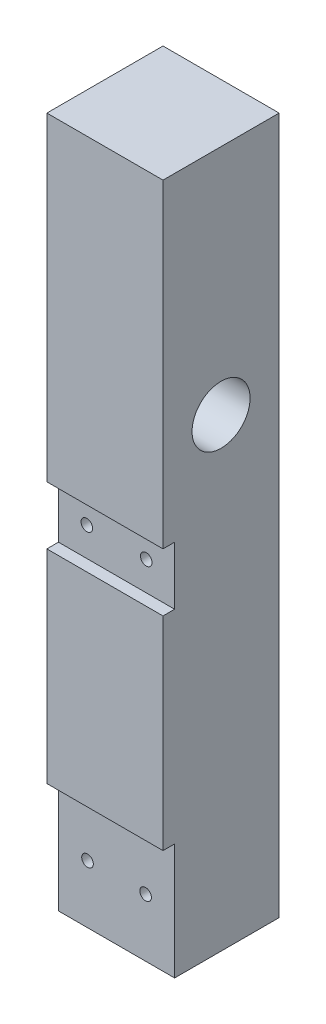
ISO-10303-21;
HEADER;
FILE_DESCRIPTION(('STEP AP214'),'2;1');
FILE_NAME('part.step','',(''),(''),'','','');
FILE_SCHEMA(('AUTOMOTIVE_DESIGN { 1 0 10303 214 1 1 1 1 }'));
ENDSEC;
DATA;
#1=APPLICATION_CONTEXT('core data for automotive mechanical design processes');
#2=APPLICATION_PROTOCOL_DEFINITION('international standard','automotive_design',2000,#1);
#3=PRODUCT_CONTEXT('',#1,'mechanical');
#4=PRODUCT('Part','Part','',(#3));
#5=PRODUCT_RELATED_PRODUCT_CATEGORY('part','',(#4));
#6=PRODUCT_DEFINITION_FORMATION('','',#4);
#7=PRODUCT_DEFINITION_CONTEXT('part definition',#1,'design');
#8=PRODUCT_DEFINITION('design','',#6,#7);
#9=PRODUCT_DEFINITION_SHAPE('','',#8);
#10=(LENGTH_UNIT() NAMED_UNIT(*) SI_UNIT(.MILLI.,.METRE.));
#11=(NAMED_UNIT(*) PLANE_ANGLE_UNIT() SI_UNIT($,.RADIAN.));
#12=(NAMED_UNIT(*) SI_UNIT($,.STERADIAN.) SOLID_ANGLE_UNIT());
#13=UNCERTAINTY_MEASURE_WITH_UNIT(LENGTH_MEASURE(1.E-05),#10,'distance_accuracy_value','');
#14=(GEOMETRIC_REPRESENTATION_CONTEXT(3) GLOBAL_UNCERTAINTY_ASSIGNED_CONTEXT((#13)) GLOBAL_UNIT_ASSIGNED_CONTEXT((#10,
#11,#12)) REPRESENTATION_CONTEXT('',''));
#15=CARTESIAN_POINT('',(0.,0.,0.));
#16=DIRECTION('',(0.,0.,1.));
#17=DIRECTION('',(1.,0.,0.));
#18=AXIS2_PLACEMENT_3D('',#15,#16,#17);
#19=CARTESIAN_POINT('',(-15.119461257796,60.,0.));
#20=DIRECTION('',(0.,0.,-1.));
#21=DIRECTION('',(0.,1.,0.));
#22=AXIS2_PLACEMENT_3D('',#19,#20,#21);
#23=CYLINDRICAL_SURFACE('',#22,1.);
#24=CARTESIAN_POINT('',(-15.119461257796,60.,-15.));
#25=DIRECTION('',(0.,0.,-1.));
#26=DIRECTION('',(0.,1.,0.));
#27=AXIS2_PLACEMENT_3D('',#24,#25,#26);
#28=CIRCLE('',#27,1.);
#29=CARTESIAN_POINT('',(-15.119461257796,61.,-15.));
#30=VERTEX_POINT('',#29);
#31=EDGE_CURVE('E42',#30,#30,#28,.T.);
#32=ORIENTED_EDGE('',*,*,#31,.T.);
#33=EDGE_LOOP('',(#32));
#34=FACE_BOUND('',#33,.T.);
#35=CARTESIAN_POINT('',(-15.119461257796,60.,-2.));
#36=DIRECTION('',(0.,0.,1.));
#37=DIRECTION('',(1.,0.,0.));
#38=AXIS2_PLACEMENT_3D('',#35,#36,#37);
#39=CIRCLE('',#38,1.);
#40=CARTESIAN_POINT('',(-14.119461257796,60.,-2.));
#41=VERTEX_POINT('',#40);
#42=EDGE_CURVE('E173',#41,#41,#39,.T.);
#43=ORIENTED_EDGE('',*,*,#42,.T.);
#44=EDGE_LOOP('',(#43));
#45=FACE_BOUND('',#44,.T.);
#46=ADVANCED_FACE('F38',(#34,#45),#23,.F.);
#47=CARTESIAN_POINT('',(-4.88053874220398,60.,0.));
#48=DIRECTION('',(0.,0.,-1.));
#49=DIRECTION('',(0.,1.,0.));
#50=AXIS2_PLACEMENT_3D('',#47,#48,#49);
#51=CYLINDRICAL_SURFACE('',#50,1.);
#52=CARTESIAN_POINT('',(-4.88053874220398,60.,-15.));
#53=DIRECTION('',(0.,0.,-1.));
#54=DIRECTION('',(0.,1.,0.));
#55=AXIS2_PLACEMENT_3D('',#52,#53,#54);
#56=CIRCLE('',#55,1.);
#57=CARTESIAN_POINT('',(-4.88053874220398,61.,-15.));
#58=VERTEX_POINT('',#57);
#59=EDGE_CURVE('E180',#58,#58,#56,.F.);
#60=ORIENTED_EDGE('',*,*,#59,.F.);
#61=EDGE_LOOP('',(#60));
#62=FACE_BOUND('',#61,.T.);
#63=CARTESIAN_POINT('',(-4.88053874220398,60.,-2.));
#64=DIRECTION('',(0.,0.,1.));
#65=DIRECTION('',(1.,0.,0.));
#66=AXIS2_PLACEMENT_3D('',#63,#64,#65);
#67=CIRCLE('',#66,1.);
#68=CARTESIAN_POINT('',(-3.88053874220398,60.,-2.));
#69=VERTEX_POINT('',#68);
#70=EDGE_CURVE('E170',#69,#69,#67,.F.);
#71=ORIENTED_EDGE('',*,*,#70,.F.);
#72=EDGE_LOOP('',(#71));
#73=FACE_BOUND('',#72,.T.);
#74=ADVANCED_FACE('F321',(#62,#73),#51,.F.);
#75=CARTESIAN_POINT('',(-20.,120.,0.));
#76=DIRECTION('',(0.,0.,1.));
#77=DIRECTION('',(0.,-1.,0.));
#78=AXIS2_PLACEMENT_3D('',#75,#76,#77);
#79=PLANE('',#78);
#80=DIRECTION('',(1.,0.,0.));
#81=VECTOR('',#80,1.);
#82=CARTESIAN_POINT('',(-20.,55.,0.));
#83=LINE('',#82,#81);
#84=CARTESIAN_POINT('',(-20.,55.,0.));
#85=VERTEX_POINT('',#84);
#86=CARTESIAN_POINT('',(0.,55.,0.));
#87=VERTEX_POINT('',#86);
#88=EDGE_CURVE('E133',#85,#87,#83,.T.);
#89=ORIENTED_EDGE('',*,*,#88,.F.);
#90=DIRECTION('',(0.,-1.,0.));
#91=VECTOR('',#90,1.);
#92=CARTESIAN_POINT('',(-20.,120.,0.));
#93=LINE('',#92,#91);
#94=CARTESIAN_POINT('',(-20.,20.,0.));
#95=VERTEX_POINT('',#94);
#96=EDGE_CURVE('E218',#85,#95,#93,.T.);
#97=ORIENTED_EDGE('',*,*,#96,.T.);
#98=DIRECTION('',(-1.,0.,0.));
#99=VECTOR('',#98,1.);
#100=CARTESIAN_POINT('',(-20.,20.,0.));
#101=LINE('',#100,#99);
#102=CARTESIAN_POINT('',(0.,20.,0.));
#103=VERTEX_POINT('',#102);
#104=EDGE_CURVE('E150',#103,#95,#101,.T.);
#105=ORIENTED_EDGE('',*,*,#104,.F.);
#106=DIRECTION('',(0.,-1.,0.));
#107=VECTOR('',#106,1.);
#108=CARTESIAN_POINT('',(0.,120.,0.));
#109=LINE('',#108,#107);
#110=EDGE_CURVE('E213',#87,#103,#109,.T.);
#111=ORIENTED_EDGE('',*,*,#110,.F.);
#112=EDGE_LOOP('',(#89,#97,#105,#111));
#113=FACE_BOUND('',#112,.T.);
#114=ADVANCED_FACE('F298',(#113),#79,.T.);
#115=CARTESIAN_POINT('',(-5.,9.99999999999999,-20.));
#116=DIRECTION('',(0.,0.,1.));
#117=DIRECTION('',(1.,0.,0.));
#118=AXIS2_PLACEMENT_3D('',#115,#116,#117);
#119=CYLINDRICAL_SURFACE('',#118,1.);
#120=CARTESIAN_POINT('',(-5.,9.99999999999999,-15.));
#121=DIRECTION('',(0.,0.,-1.));
#122=DIRECTION('',(0.,1.,0.));
#123=AXIS2_PLACEMENT_3D('',#120,#121,#122);
#124=CIRCLE('',#123,1.);
#125=CARTESIAN_POINT('',(-5.,11.,-15.));
#126=VERTEX_POINT('',#125);
#127=EDGE_CURVE('E209',#126,#126,#124,.T.);
#128=ORIENTED_EDGE('',*,*,#127,.T.);
#129=EDGE_LOOP('',(#128));
#130=FACE_BOUND('',#129,.T.);
#131=CARTESIAN_POINT('',(-5.,9.99999999999999,-2.));
#132=DIRECTION('',(0.,0.,1.));
#133=DIRECTION('',(1.,0.,0.));
#134=AXIS2_PLACEMENT_3D('',#131,#132,#133);
#135=CIRCLE('',#134,1.);
#136=CARTESIAN_POINT('',(-4.,9.99999999999999,-2.));
#137=VERTEX_POINT('',#136);
#138=EDGE_CURVE('E166',#137,#137,#135,.T.);
#139=ORIENTED_EDGE('',*,*,#138,.T.);
#140=EDGE_LOOP('',(#139));
#141=FACE_BOUND('',#140,.T.);
#142=ADVANCED_FACE('F317',(#130,#141),#119,.F.);
#143=CARTESIAN_POINT('',(-15.,9.99999999999999,-20.));
#144=DIRECTION('',(0.,0.,1.));
#145=DIRECTION('',(1.,0.,0.));
#146=AXIS2_PLACEMENT_3D('',#143,#144,#145);
#147=CYLINDRICAL_SURFACE('',#146,1.);
#148=CARTESIAN_POINT('',(-15.,9.99999999999999,-15.));
#149=DIRECTION('',(0.,0.,-1.));
#150=DIRECTION('',(0.,1.,0.));
#151=AXIS2_PLACEMENT_3D('',#148,#149,#150);
#152=CIRCLE('',#151,1.);
#153=CARTESIAN_POINT('',(-15.,11.,-15.));
#154=VERTEX_POINT('',#153);
#155=EDGE_CURVE('E192',#154,#154,#152,.F.);
#156=ORIENTED_EDGE('',*,*,#155,.F.);
#157=EDGE_LOOP('',(#156));
#158=FACE_BOUND('',#157,.T.);
#159=CARTESIAN_POINT('',(-15.,9.99999999999999,-2.));
#160=DIRECTION('',(0.,0.,1.));
#161=DIRECTION('',(1.,0.,0.));
#162=AXIS2_PLACEMENT_3D('',#159,#160,#161);
#163=CIRCLE('',#162,1.);
#164=CARTESIAN_POINT('',(-14.,9.99999999999999,-2.));
#165=VERTEX_POINT('',#164);
#166=EDGE_CURVE('E163',#165,#165,#163,.F.);
#167=ORIENTED_EDGE('',*,*,#166,.F.);
#168=EDGE_LOOP('',(#167));
#169=FACE_BOUND('',#168,.T.);
#170=ADVANCED_FACE('F312',(#158,#169),#147,.F.);
#171=CARTESIAN_POINT('',(-20.,0.,0.));
#172=DIRECTION('',(0.,-1.,0.));
#173=DIRECTION('',(0.,0.,-1.));
#174=AXIS2_PLACEMENT_3D('',#171,#172,#173);
#175=PLANE('',#174);
#176=DIRECTION('',(0.,0.,-1.));
#177=VECTOR('',#176,1.);
#178=CARTESIAN_POINT('',(0.,0.,0.));
#179=LINE('',#178,#177);
#180=CARTESIAN_POINT('',(0.,0.,-2.));
#181=VERTEX_POINT('',#180);
#182=CARTESIAN_POINT('',(0.,0.,-20.));
#183=VERTEX_POINT('',#182);
#184=EDGE_CURVE('E228',#181,#183,#179,.T.);
#185=ORIENTED_EDGE('',*,*,#184,.F.);
#186=DIRECTION('',(1.,0.,0.));
#187=VECTOR('',#186,1.);
#188=CARTESIAN_POINT('',(-20.,0.,-2.));
#189=LINE('',#188,#187);
#190=CARTESIAN_POINT('',(-20.,0.,-2.));
#191=VERTEX_POINT('',#190);
#192=EDGE_CURVE('E63',#191,#181,#189,.T.);
#193=ORIENTED_EDGE('',*,*,#192,.F.);
#194=DIRECTION('',(0.,0.,-1.));
#195=VECTOR('',#194,1.);
#196=CARTESIAN_POINT('',(-20.,0.,0.));
#197=LINE('',#196,#195);
#198=CARTESIAN_POINT('',(-20.,0.,-20.));
#199=VERTEX_POINT('',#198);
#200=EDGE_CURVE('E217',#191,#199,#197,.T.);
#201=ORIENTED_EDGE('',*,*,#200,.T.);
#202=DIRECTION('',(1.,0.,0.));
#203=VECTOR('',#202,1.);
#204=CARTESIAN_POINT('',(-20.,0.,-20.));
#205=LINE('',#204,#203);
#206=EDGE_CURVE('E226',#199,#183,#205,.T.);
#207=ORIENTED_EDGE('',*,*,#206,.T.);
#208=EDGE_LOOP('',(#185,#193,#201,#207));
#209=FACE_BOUND('',#208,.T.);
#210=ADVANCED_FACE('F310',(#209),#175,.T.);
#211=DIRECTION('',(-1.,0.,0.));
#212=VECTOR('',#211,1.);
#213=CARTESIAN_POINT('',(-20.,65.,0.));
#214=LINE('',#213,#212);
#215=CARTESIAN_POINT('',(0.,65.,0.));
#216=VERTEX_POINT('',#215);
#217=CARTESIAN_POINT('',(-20.,65.,0.));
#218=VERTEX_POINT('',#217);
#219=EDGE_CURVE('E161',#216,#218,#214,.T.);
#220=ORIENTED_EDGE('',*,*,#219,.F.);
#221=CARTESIAN_POINT('',(0.,120.,0.));
#222=VERTEX_POINT('',#221);
#223=EDGE_CURVE('E140',#222,#216,#109,.T.);
#224=ORIENTED_EDGE('',*,*,#223,.F.);
#225=DIRECTION('',(1.,0.,0.));
#226=VECTOR('',#225,1.);
#227=CARTESIAN_POINT('',(-20.,120.,0.));
#228=LINE('',#227,#226);
#229=CARTESIAN_POINT('',(-20.,120.,0.));
#230=VERTEX_POINT('',#229);
#231=EDGE_CURVE('E12',#230,#222,#228,.T.);
#232=ORIENTED_EDGE('',*,*,#231,.F.);
#233=EDGE_CURVE('E214',#230,#218,#93,.T.);
#234=ORIENTED_EDGE('',*,*,#233,.T.);
#235=EDGE_LOOP('',(#220,#224,#232,#234));
#236=FACE_BOUND('',#235,.T.);
#237=ADVANCED_FACE('F40',(#236),#79,.T.);
#238=CARTESIAN_POINT('',(-20.,120.,-20.));
#239=DIRECTION('',(0.,0.,-1.));
#240=DIRECTION('',(0.,1.,0.));
#241=AXIS2_PLACEMENT_3D('',#238,#239,#240);
#242=PLANE('',#241);
#243=CARTESIAN_POINT('',(-4.88053874220398,60.,-20.));
#244=DIRECTION('',(0.,0.,-1.));
#245=DIRECTION('',(0.,1.,0.));
#246=AXIS2_PLACEMENT_3D('',#243,#244,#245);
#247=CIRCLE('',#246,2.);
#248=CARTESIAN_POINT('',(-4.88053874220398,62.,-20.));
#249=VERTEX_POINT('',#248);
#250=EDGE_CURVE('E181',#249,#249,#247,.T.);
#251=ORIENTED_EDGE('',*,*,#250,.F.);
#252=EDGE_LOOP('',(#251));
#253=FACE_BOUND('',#252,.T.);
#254=CARTESIAN_POINT('',(-15.119461257796,60.,-20.));
#255=DIRECTION('',(0.,0.,-1.));
#256=DIRECTION('',(0.,1.,0.));
#257=AXIS2_PLACEMENT_3D('',#254,#255,#256);
#258=CIRCLE('',#257,2.);
#259=CARTESIAN_POINT('',(-15.119461257796,62.,-20.));
#260=VERTEX_POINT('',#259);
#261=EDGE_CURVE('E176',#260,#260,#258,.T.);
#262=ORIENTED_EDGE('',*,*,#261,.F.);
#263=EDGE_LOOP('',(#262));
#264=FACE_BOUND('',#263,.T.);
#265=CARTESIAN_POINT('',(-5.,9.99999999999999,-20.));
#266=DIRECTION('',(0.,0.,-1.));
#267=DIRECTION('',(0.,1.,0.));
#268=AXIS2_PLACEMENT_3D('',#265,#266,#267);
#269=CIRCLE('',#268,2.);
#270=CARTESIAN_POINT('',(-5.,12.,-20.));
#271=VERTEX_POINT('',#270);
#272=EDGE_CURVE('E193',#271,#271,#269,.T.);
#273=ORIENTED_EDGE('',*,*,#272,.F.);
#274=EDGE_LOOP('',(#273));
#275=FACE_BOUND('',#274,.T.);
#276=CARTESIAN_POINT('',(-15.,9.99999999999999,-20.));
#277=DIRECTION('',(0.,0.,-1.));
#278=DIRECTION('',(0.,1.,0.));
#279=AXIS2_PLACEMENT_3D('',#276,#277,#278);
#280=CIRCLE('',#279,2.);
#281=CARTESIAN_POINT('',(-15.,12.,-20.));
#282=VERTEX_POINT('',#281);
#283=EDGE_CURVE('E199',#282,#282,#280,.T.);
#284=ORIENTED_EDGE('',*,*,#283,.F.);
#285=EDGE_LOOP('',(#284));
#286=FACE_BOUND('',#285,.T.);
#287=DIRECTION('',(0.,1.,0.));
#288=VECTOR('',#287,1.);
#289=CARTESIAN_POINT('',(0.,120.,-20.));
#290=LINE('',#289,#288);
#291=CARTESIAN_POINT('',(0.,120.,-20.));
#292=VERTEX_POINT('',#291);
#293=EDGE_CURVE('E230',#183,#292,#290,.T.);
#294=ORIENTED_EDGE('',*,*,#293,.F.);
#295=ORIENTED_EDGE('',*,*,#206,.F.);
#296=DIRECTION('',(0.,1.,0.));
#297=VECTOR('',#296,1.);
#298=CARTESIAN_POINT('',(-20.,120.,-20.));
#299=LINE('',#298,#297);
#300=CARTESIAN_POINT('',(-20.,120.,-20.));
#301=VERTEX_POINT('',#300);
#302=EDGE_CURVE('E220',#199,#301,#299,.T.);
#303=ORIENTED_EDGE('',*,*,#302,.T.);
#304=DIRECTION('',(1.,0.,0.));
#305=VECTOR('',#304,1.);
#306=CARTESIAN_POINT('',(-20.,120.,-20.));
#307=LINE('',#306,#305);
#308=EDGE_CURVE('E47',#301,#292,#307,.T.);
#309=ORIENTED_EDGE('',*,*,#308,.T.);
#310=EDGE_LOOP('',(#294,#295,#303,#309));
#311=FACE_BOUND('',#310,.T.);
#312=ADVANCED_FACE('F265',(#253,#264,#275,#286,#311),#242,.T.);
#313=CARTESIAN_POINT('',(-20.,80.,-10.));
#314=DIRECTION('',(1.,0.,0.));
#315=DIRECTION('',(0.,0.,-1.));
#316=AXIS2_PLACEMENT_3D('',#313,#314,#315);
#317=CYLINDRICAL_SURFACE('',#316,2.5);
#318=CARTESIAN_POINT('',(-20.,80.,-10.));
#319=DIRECTION('',(1.,0.,0.));
#320=DIRECTION('',(0.,0.,-1.));
#321=AXIS2_PLACEMENT_3D('',#318,#319,#320);
#322=CIRCLE('',#321,2.5);
#323=CARTESIAN_POINT('',(-20.,80.,-12.5));
#324=VERTEX_POINT('',#323);
#325=EDGE_CURVE('E210',#324,#324,#322,.T.);
#326=ORIENTED_EDGE('',*,*,#325,.F.);
#327=EDGE_LOOP('',(#326));
#328=FACE_BOUND('',#327,.T.);
#329=CARTESIAN_POINT('',(-10.,80.,-10.));
#330=DIRECTION('',(1.,0.,0.));
#331=DIRECTION('',(0.,0.,-1.));
#332=AXIS2_PLACEMENT_3D('',#329,#330,#331);
#333=CIRCLE('',#332,2.5);
#334=CARTESIAN_POINT('',(-10.,80.,-12.5));
#335=VERTEX_POINT('',#334);
#336=EDGE_CURVE('E205',#335,#335,#333,.F.);
#337=ORIENTED_EDGE('',*,*,#336,.F.);
#338=EDGE_LOOP('',(#337));
#339=FACE_BOUND('',#338,.T.);
#340=ADVANCED_FACE('F268',(#328,#339),#317,.F.);
#341=CARTESIAN_POINT('',(-20.,120.,0.));
#342=DIRECTION('',(0.,1.,0.));
#343=DIRECTION('',(0.,0.,1.));
#344=AXIS2_PLACEMENT_3D('',#341,#342,#343);
#345=PLANE('',#344);
#346=DIRECTION('',(0.,0.,1.));
#347=VECTOR('',#346,1.);
#348=CARTESIAN_POINT('',(0.,120.,0.));
#349=LINE('',#348,#347);
#350=EDGE_CURVE('E233',#292,#222,#349,.T.);
#351=ORIENTED_EDGE('',*,*,#350,.F.);
#352=ORIENTED_EDGE('',*,*,#308,.F.);
#353=DIRECTION('',(0.,0.,1.));
#354=VECTOR('',#353,1.);
#355=CARTESIAN_POINT('',(-20.,120.,0.));
#356=LINE('',#355,#354);
#357=EDGE_CURVE('E223',#301,#230,#356,.T.);
#358=ORIENTED_EDGE('',*,*,#357,.T.);
#359=ORIENTED_EDGE('',*,*,#231,.T.);
#360=EDGE_LOOP('',(#351,#352,#358,#359));
#361=FACE_BOUND('',#360,.T.);
#362=ADVANCED_FACE('F281',(#361),#345,.T.);
#363=CARTESIAN_POINT('',(-20.,0.,0.));
#364=DIRECTION('',(1.,0.,0.));
#365=DIRECTION('',(0.,0.,-1.));
#366=AXIS2_PLACEMENT_3D('',#363,#364,#365);
#367=PLANE('',#366);
#368=ORIENTED_EDGE('',*,*,#96,.F.);
#369=DIRECTION('',(0.,0.,1.));
#370=VECTOR('',#369,1.);
#371=CARTESIAN_POINT('',(-20.,55.,-2.));
#372=LINE('',#371,#370);
#373=CARTESIAN_POINT('',(-20.,55.,-2.));
#374=VERTEX_POINT('',#373);
#375=EDGE_CURVE('E142',#374,#85,#372,.T.);
#376=ORIENTED_EDGE('',*,*,#375,.F.);
#377=DIRECTION('',(0.,-1.,0.));
#378=VECTOR('',#377,1.);
#379=CARTESIAN_POINT('',(-20.,65.,-2.));
#380=LINE('',#379,#378);
#381=CARTESIAN_POINT('',(-20.,65.,-2.));
#382=VERTEX_POINT('',#381);
#383=EDGE_CURVE('E125',#382,#374,#380,.T.);
#384=ORIENTED_EDGE('',*,*,#383,.F.);
#385=DIRECTION('',(0.,0.,1.));
#386=VECTOR('',#385,1.);
#387=CARTESIAN_POINT('',(-20.,65.,-2.));
#388=LINE('',#387,#386);
#389=EDGE_CURVE('E123',#382,#218,#388,.T.);
#390=ORIENTED_EDGE('',*,*,#389,.T.);
#391=ORIENTED_EDGE('',*,*,#233,.F.);
#392=ORIENTED_EDGE('',*,*,#357,.F.);
#393=ORIENTED_EDGE('',*,*,#302,.F.);
#394=ORIENTED_EDGE('',*,*,#200,.F.);
#395=DIRECTION('',(0.,-1.,0.));
#396=VECTOR('',#395,1.);
#397=CARTESIAN_POINT('',(-20.,20.,-2.));
#398=LINE('',#397,#396);
#399=CARTESIAN_POINT('',(-20.,20.,-2.));
#400=VERTEX_POINT('',#399);
#401=EDGE_CURVE('E153',#400,#191,#398,.T.);
#402=ORIENTED_EDGE('',*,*,#401,.F.);
#403=DIRECTION('',(0.,0.,1.));
#404=VECTOR('',#403,1.);
#405=CARTESIAN_POINT('',(-20.,20.,-2.));
#406=LINE('',#405,#404);
#407=EDGE_CURVE('E158',#400,#95,#406,.T.);
#408=ORIENTED_EDGE('',*,*,#407,.T.);
#409=EDGE_LOOP('',(#368,#376,#384,#390,#391,#392,#393,#394,#402,#408));
#410=FACE_BOUND('',#409,.T.);
#411=ORIENTED_EDGE('',*,*,#325,.T.);
#412=EDGE_LOOP('',(#411));
#413=FACE_BOUND('',#412,.T.);
#414=ADVANCED_FACE('F301',(#410,#413),#367,.F.);
#415=CARTESIAN_POINT('',(0.,0.,0.));
#416=DIRECTION('',(1.,0.,0.));
#417=DIRECTION('',(0.,0.,-1.));
#418=AXIS2_PLACEMENT_3D('',#415,#416,#417);
#419=PLANE('',#418);
#420=DIRECTION('',(0.,0.,1.));
#421=VECTOR('',#420,1.);
#422=CARTESIAN_POINT('',(0.,55.,-2.));
#423=LINE('',#422,#421);
#424=CARTESIAN_POINT('',(0.,55.,-2.));
#425=VERTEX_POINT('',#424);
#426=EDGE_CURVE('E167',#425,#87,#423,.T.);
#427=ORIENTED_EDGE('',*,*,#426,.T.);
#428=ORIENTED_EDGE('',*,*,#110,.T.);
#429=DIRECTION('',(0.,0.,1.));
#430=VECTOR('',#429,1.);
#431=CARTESIAN_POINT('',(0.,20.,-2.));
#432=LINE('',#431,#430);
#433=CARTESIAN_POINT('',(0.,20.,-2.));
#434=VERTEX_POINT('',#433);
#435=EDGE_CURVE('E156',#434,#103,#432,.T.);
#436=ORIENTED_EDGE('',*,*,#435,.F.);
#437=DIRECTION('',(0.,1.,0.));
#438=VECTOR('',#437,1.);
#439=CARTESIAN_POINT('',(0.,20.,-2.));
#440=LINE('',#439,#438);
#441=EDGE_CURVE('E147',#181,#434,#440,.T.);
#442=ORIENTED_EDGE('',*,*,#441,.F.);
#443=ORIENTED_EDGE('',*,*,#184,.T.);
#444=ORIENTED_EDGE('',*,*,#293,.T.);
#445=ORIENTED_EDGE('',*,*,#350,.T.);
#446=ORIENTED_EDGE('',*,*,#223,.T.);
#447=DIRECTION('',(0.,0.,1.));
#448=VECTOR('',#447,1.);
#449=CARTESIAN_POINT('',(0.,65.,-2.));
#450=LINE('',#449,#448);
#451=CARTESIAN_POINT('',(0.,65.,-2.));
#452=VERTEX_POINT('',#451);
#453=EDGE_CURVE('E120',#452,#216,#450,.T.);
#454=ORIENTED_EDGE('',*,*,#453,.F.);
#455=DIRECTION('',(0.,1.,0.));
#456=VECTOR('',#455,1.);
#457=CARTESIAN_POINT('',(0.,65.,-2.));
#458=LINE('',#457,#456);
#459=EDGE_CURVE('E126',#425,#452,#458,.T.);
#460=ORIENTED_EDGE('',*,*,#459,.F.);
#461=EDGE_LOOP('',(#427,#428,#436,#442,#443,#444,#445,#446,#454,#460));
#462=FACE_BOUND('',#461,.T.);
#463=CARTESIAN_POINT('',(0.,80.,-10.));
#464=DIRECTION('',(1.,0.,0.));
#465=DIRECTION('',(0.,0.,-1.));
#466=AXIS2_PLACEMENT_3D('',#463,#464,#465);
#467=CIRCLE('',#466,5.);
#468=CARTESIAN_POINT('',(0.,80.,-15.));
#469=VERTEX_POINT('',#468);
#470=EDGE_CURVE('E206',#469,#469,#467,.T.);
#471=ORIENTED_EDGE('',*,*,#470,.F.);
#472=EDGE_LOOP('',(#471));
#473=FACE_BOUND('',#472,.T.);
#474=ADVANCED_FACE('F136',(#462,#473),#419,.T.);
#475=CARTESIAN_POINT('',(-10.,80.,-10.));
#476=DIRECTION('',(1.,0.,0.));
#477=DIRECTION('',(0.,0.,-1.));
#478=AXIS2_PLACEMENT_3D('',#475,#476,#477);
#479=PLANE('',#478);
#480=CARTESIAN_POINT('',(-10.,80.,-10.));
#481=DIRECTION('',(1.,0.,0.));
#482=DIRECTION('',(0.,0.,-1.));
#483=AXIS2_PLACEMENT_3D('',#480,#481,#482);
#484=CIRCLE('',#483,5.);
#485=CARTESIAN_POINT('',(-10.,80.,-15.));
#486=VERTEX_POINT('',#485);
#487=EDGE_CURVE('E202',#486,#486,#484,.T.);
#488=ORIENTED_EDGE('',*,*,#487,.T.);
#489=EDGE_LOOP('',(#488));
#490=FACE_BOUND('',#489,.T.);
#491=ORIENTED_EDGE('',*,*,#336,.T.);
#492=EDGE_LOOP('',(#491));
#493=FACE_BOUND('',#492,.T.);
#494=ADVANCED_FACE('F350',(#490,#493),#479,.T.);
#495=CARTESIAN_POINT('',(-10.,80.,-10.));
#496=DIRECTION('',(1.,0.,0.));
#497=DIRECTION('',(0.,0.,-1.));
#498=AXIS2_PLACEMENT_3D('',#495,#496,#497);
#499=CYLINDRICAL_SURFACE('',#498,5.);
#500=ORIENTED_EDGE('',*,*,#487,.F.);
#501=EDGE_LOOP('',(#500));
#502=FACE_BOUND('',#501,.T.);
#503=ORIENTED_EDGE('',*,*,#470,.T.);
#504=EDGE_LOOP('',(#503));
#505=FACE_BOUND('',#504,.T.);
#506=ADVANCED_FACE('F342',(#502,#505),#499,.F.);
#507=CARTESIAN_POINT('',(-15.,9.99999999999999,-15.));
#508=DIRECTION('',(0.,0.,-1.));
#509=DIRECTION('',(0.,1.,0.));
#510=AXIS2_PLACEMENT_3D('',#507,#508,#509);
#511=PLANE('',#510);
#512=CARTESIAN_POINT('',(-15.,9.99999999999999,-15.));
#513=DIRECTION('',(0.,0.,-1.));
#514=DIRECTION('',(0.,1.,0.));
#515=AXIS2_PLACEMENT_3D('',#512,#513,#514);
#516=CIRCLE('',#515,2.);
#517=CARTESIAN_POINT('',(-15.,12.,-15.));
#518=VERTEX_POINT('',#517);
#519=EDGE_CURVE('E196',#518,#518,#516,.T.);
#520=ORIENTED_EDGE('',*,*,#519,.T.);
#521=EDGE_LOOP('',(#520));
#522=FACE_BOUND('',#521,.T.);
#523=ORIENTED_EDGE('',*,*,#155,.T.);
#524=EDGE_LOOP('',(#523));
#525=FACE_BOUND('',#524,.T.);
#526=ADVANCED_FACE('F339',(#522,#525),#511,.T.);
#527=CARTESIAN_POINT('',(-15.,9.99999999999999,-15.));
#528=DIRECTION('',(0.,0.,-1.));
#529=DIRECTION('',(0.,1.,0.));
#530=AXIS2_PLACEMENT_3D('',#527,#528,#529);
#531=CYLINDRICAL_SURFACE('',#530,2.);
#532=ORIENTED_EDGE('',*,*,#519,.F.);
#533=EDGE_LOOP('',(#532));
#534=FACE_BOUND('',#533,.T.);
#535=ORIENTED_EDGE('',*,*,#283,.T.);
#536=EDGE_LOOP('',(#535));
#537=FACE_BOUND('',#536,.T.);
#538=ADVANCED_FACE('F337',(#534,#537),#531,.F.);
#539=CARTESIAN_POINT('',(-5.,9.99999999999999,-15.));
#540=DIRECTION('',(0.,0.,-1.));
#541=DIRECTION('',(0.,1.,0.));
#542=AXIS2_PLACEMENT_3D('',#539,#540,#541);
#543=CYLINDRICAL_SURFACE('',#542,2.);
#544=CARTESIAN_POINT('',(-5.,9.99999999999999,-15.));
#545=DIRECTION('',(0.,0.,-1.));
#546=DIRECTION('',(0.,1.,0.));
#547=AXIS2_PLACEMENT_3D('',#544,#545,#546);
#548=CIRCLE('',#547,2.);
#549=CARTESIAN_POINT('',(-5.,12.,-15.));
#550=VERTEX_POINT('',#549);
#551=EDGE_CURVE('E189',#550,#550,#548,.T.);
#552=ORIENTED_EDGE('',*,*,#551,.F.);
#553=EDGE_LOOP('',(#552));
#554=FACE_BOUND('',#553,.T.);
#555=ORIENTED_EDGE('',*,*,#272,.T.);
#556=EDGE_LOOP('',(#555));
#557=FACE_BOUND('',#556,.T.);
#558=ADVANCED_FACE('F333',(#554,#557),#543,.F.);
#559=CARTESIAN_POINT('',(-5.,9.99999999999999,-15.));
#560=DIRECTION('',(0.,0.,-1.));
#561=DIRECTION('',(0.,1.,0.));
#562=AXIS2_PLACEMENT_3D('',#559,#560,#561);
#563=PLANE('',#562);
#564=ORIENTED_EDGE('',*,*,#127,.F.);
#565=EDGE_LOOP('',(#564));
#566=FACE_BOUND('',#565,.T.);
#567=ORIENTED_EDGE('',*,*,#551,.T.);
#568=EDGE_LOOP('',(#567));
#569=FACE_BOUND('',#568,.T.);
#570=ADVANCED_FACE('F329',(#566,#569),#563,.T.);
#571=CARTESIAN_POINT('',(-4.88053874220398,60.,-15.));
#572=DIRECTION('',(0.,0.,-1.));
#573=DIRECTION('',(0.,1.,0.));
#574=AXIS2_PLACEMENT_3D('',#571,#572,#573);
#575=PLANE('',#574);
#576=CARTESIAN_POINT('',(-4.88053874220398,60.,-15.));
#577=DIRECTION('',(0.,0.,-1.));
#578=DIRECTION('',(0.,1.,0.));
#579=AXIS2_PLACEMENT_3D('',#576,#577,#578);
#580=CIRCLE('',#579,2.);
#581=CARTESIAN_POINT('',(-4.88053874220398,62.,-15.));
#582=VERTEX_POINT('',#581);
#583=EDGE_CURVE('E177',#582,#582,#580,.T.);
#584=ORIENTED_EDGE('',*,*,#583,.T.);
#585=EDGE_LOOP('',(#584));
#586=FACE_BOUND('',#585,.T.);
#587=ORIENTED_EDGE('',*,*,#59,.T.);
#588=EDGE_LOOP('',(#587));
#589=FACE_BOUND('',#588,.T.);
#590=ADVANCED_FACE('F332',(#586,#589),#575,.T.);
#591=CARTESIAN_POINT('',(-4.88053874220398,60.,-15.));
#592=DIRECTION('',(0.,0.,-1.));
#593=DIRECTION('',(0.,1.,0.));
#594=AXIS2_PLACEMENT_3D('',#591,#592,#593);
#595=CYLINDRICAL_SURFACE('',#594,2.);
#596=ORIENTED_EDGE('',*,*,#583,.F.);
#597=EDGE_LOOP('',(#596));
#598=FACE_BOUND('',#597,.T.);
#599=ORIENTED_EDGE('',*,*,#250,.T.);
#600=EDGE_LOOP('',(#599));
#601=FACE_BOUND('',#600,.T.);
#602=ADVANCED_FACE('F261',(#598,#601),#595,.F.);
#603=CARTESIAN_POINT('',(-15.119461257796,60.,-15.));
#604=DIRECTION('',(0.,0.,-1.));
#605=DIRECTION('',(0.,1.,0.));
#606=AXIS2_PLACEMENT_3D('',#603,#604,#605);
#607=CYLINDRICAL_SURFACE('',#606,2.);
#608=CARTESIAN_POINT('',(-15.119461257796,60.,-15.));
#609=DIRECTION('',(0.,0.,-1.));
#610=DIRECTION('',(0.,1.,0.));
#611=AXIS2_PLACEMENT_3D('',#608,#609,#610);
#612=CIRCLE('',#611,2.);
#613=CARTESIAN_POINT('',(-15.119461257796,62.,-15.));
#614=VERTEX_POINT('',#613);
#615=EDGE_CURVE('E184',#614,#614,#612,.T.);
#616=ORIENTED_EDGE('',*,*,#615,.F.);
#617=EDGE_LOOP('',(#616));
#618=FACE_BOUND('',#617,.T.);
#619=ORIENTED_EDGE('',*,*,#261,.T.);
#620=EDGE_LOOP('',(#619));
#621=FACE_BOUND('',#620,.T.);
#622=ADVANCED_FACE('F255',(#618,#621),#607,.F.);
#623=CARTESIAN_POINT('',(-15.119461257796,60.,-15.));
#624=DIRECTION('',(0.,0.,-1.));
#625=DIRECTION('',(0.,1.,0.));
#626=AXIS2_PLACEMENT_3D('',#623,#624,#625);
#627=PLANE('',#626);
#628=ORIENTED_EDGE('',*,*,#31,.F.);
#629=EDGE_LOOP('',(#628));
#630=FACE_BOUND('',#629,.T.);
#631=ORIENTED_EDGE('',*,*,#615,.T.);
#632=EDGE_LOOP('',(#631));
#633=FACE_BOUND('',#632,.T.);
#634=ADVANCED_FACE('F251',(#630,#633),#627,.T.);
#635=CARTESIAN_POINT('',(0.,0.,-2.));
#636=DIRECTION('',(0.,0.,1.));
#637=DIRECTION('',(1.,0.,0.));
#638=AXIS2_PLACEMENT_3D('',#635,#636,#637);
#639=PLANE('',#638);
#640=ORIENTED_EDGE('',*,*,#138,.F.);
#641=EDGE_LOOP('',(#640));
#642=FACE_BOUND('',#641,.T.);
#643=ORIENTED_EDGE('',*,*,#441,.T.);
#644=DIRECTION('',(-1.,0.,0.));
#645=VECTOR('',#644,1.);
#646=CARTESIAN_POINT('',(-20.,20.,-2.));
#647=LINE('',#646,#645);
#648=EDGE_CURVE('E149',#434,#400,#647,.T.);
#649=ORIENTED_EDGE('',*,*,#648,.T.);
#650=ORIENTED_EDGE('',*,*,#401,.T.);
#651=ORIENTED_EDGE('',*,*,#192,.T.);
#652=EDGE_LOOP('',(#643,#649,#650,#651));
#653=FACE_BOUND('',#652,.T.);
#654=ORIENTED_EDGE('',*,*,#166,.T.);
#655=EDGE_LOOP('',(#654));
#656=FACE_BOUND('',#655,.T.);
#657=ADVANCED_FACE('F254',(#642,#653,#656),#639,.T.);
#658=CARTESIAN_POINT('',(-20.,20.,-2.));
#659=DIRECTION('',(0.,1.,0.));
#660=DIRECTION('',(-1.,0.,0.));
#661=AXIS2_PLACEMENT_3D('',#658,#659,#660);
#662=PLANE('',#661);
#663=ORIENTED_EDGE('',*,*,#104,.T.);
#664=ORIENTED_EDGE('',*,*,#407,.F.);
#665=ORIENTED_EDGE('',*,*,#648,.F.);
#666=ORIENTED_EDGE('',*,*,#435,.T.);
#667=EDGE_LOOP('',(#663,#664,#665,#666));
#668=FACE_BOUND('',#667,.T.);
#669=ADVANCED_FACE('F306',(#668),#662,.F.);
#670=CARTESIAN_POINT('',(0.,0.,-2.));
#671=DIRECTION('',(0.,0.,1.));
#672=DIRECTION('',(1.,0.,0.));
#673=AXIS2_PLACEMENT_3D('',#670,#671,#672);
#674=PLANE('',#673);
#675=ORIENTED_EDGE('',*,*,#42,.F.);
#676=EDGE_LOOP('',(#675));
#677=FACE_BOUND('',#676,.T.);
#678=ORIENTED_EDGE('',*,*,#459,.T.);
#679=DIRECTION('',(-1.,0.,0.));
#680=VECTOR('',#679,1.);
#681=CARTESIAN_POINT('',(-20.,65.,-2.));
#682=LINE('',#681,#680);
#683=EDGE_CURVE('E117',#452,#382,#682,.T.);
#684=ORIENTED_EDGE('',*,*,#683,.T.);
#685=ORIENTED_EDGE('',*,*,#383,.T.);
#686=DIRECTION('',(1.,0.,0.));
#687=VECTOR('',#686,1.);
#688=CARTESIAN_POINT('',(-20.,55.,-2.));
#689=LINE('',#688,#687);
#690=EDGE_CURVE('E55',#374,#425,#689,.T.);
#691=ORIENTED_EDGE('',*,*,#690,.T.);
#692=EDGE_LOOP('',(#678,#684,#685,#691));
#693=FACE_BOUND('',#692,.T.);
#694=ORIENTED_EDGE('',*,*,#70,.T.);
#695=EDGE_LOOP('',(#694));
#696=FACE_BOUND('',#695,.T.);
#697=ADVANCED_FACE('F129',(#677,#693,#696),#674,.T.);
#698=CARTESIAN_POINT('',(-20.,55.,-2.));
#699=DIRECTION('',(0.,-1.,0.));
#700=DIRECTION('',(0.,0.,-1.));
#701=AXIS2_PLACEMENT_3D('',#698,#699,#700);
#702=PLANE('',#701);
#703=ORIENTED_EDGE('',*,*,#88,.T.);
#704=ORIENTED_EDGE('',*,*,#426,.F.);
#705=ORIENTED_EDGE('',*,*,#690,.F.);
#706=ORIENTED_EDGE('',*,*,#375,.T.);
#707=EDGE_LOOP('',(#703,#704,#705,#706));
#708=FACE_BOUND('',#707,.T.);
#709=ADVANCED_FACE('F292',(#708),#702,.F.);
#710=CARTESIAN_POINT('',(-20.,65.,-2.));
#711=DIRECTION('',(0.,1.,0.));
#712=DIRECTION('',(0.,0.,1.));
#713=AXIS2_PLACEMENT_3D('',#710,#711,#712);
#714=PLANE('',#713);
#715=ORIENTED_EDGE('',*,*,#219,.T.);
#716=ORIENTED_EDGE('',*,*,#389,.F.);
#717=ORIENTED_EDGE('',*,*,#683,.F.);
#718=ORIENTED_EDGE('',*,*,#453,.T.);
#719=EDGE_LOOP('',(#715,#716,#717,#718));
#720=FACE_BOUND('',#719,.T.);
#721=ADVANCED_FACE('F118',(#720),#714,.F.);
#722=CLOSED_SHELL('',(#46,#74,#114,#142,#170,#210,#237,#312,#340,#362,#414,#474,#494,#506,#526,
#538,#558,#570,#590,#602,#622,#634,#657,#669,#697,#709,#721));
#723=MANIFOLD_SOLID_BREP('B2',#722);
#724=ADVANCED_BREP_SHAPE_REPRESENTATION('',(#18,#723),#14);
#725=SHAPE_DEFINITION_REPRESENTATION(#9,#724);
ENDSEC;
END-ISO-10303-21;
